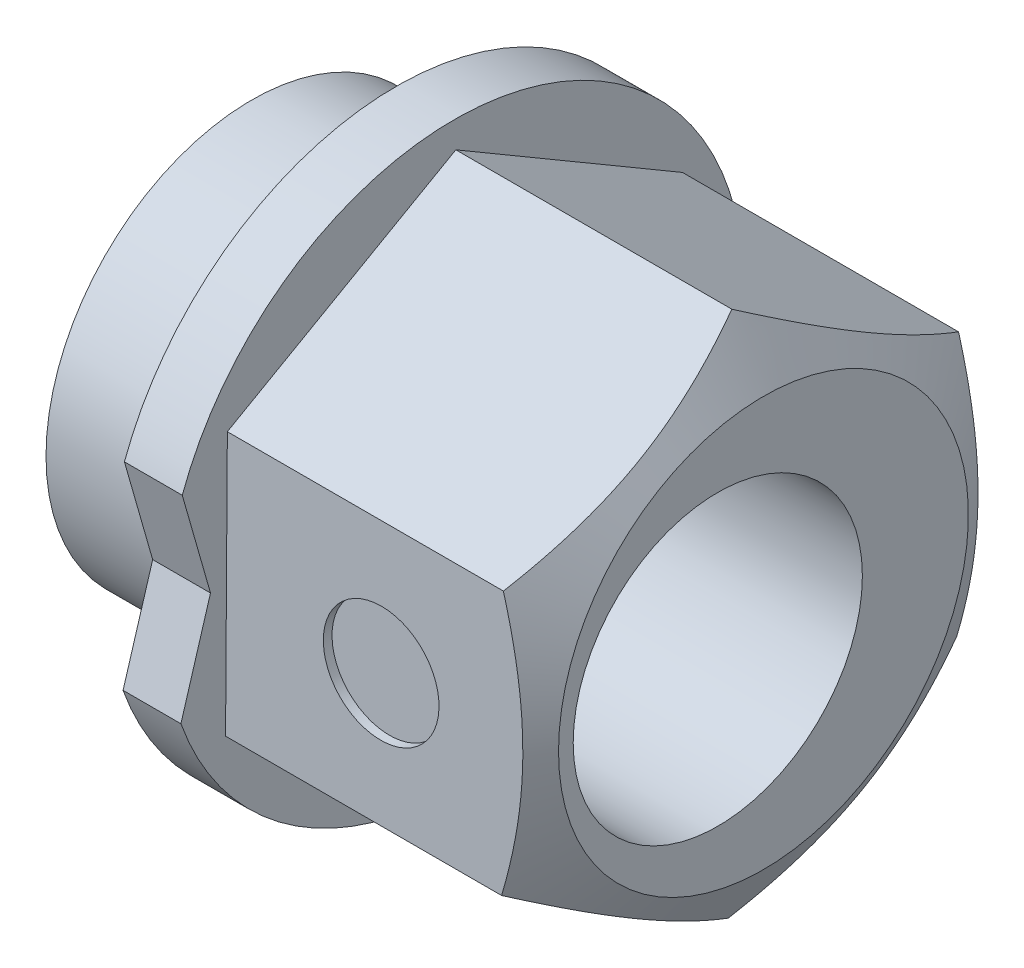
ISO-10303-21;
HEADER;
FILE_DESCRIPTION(('STEP AP214'),'2;1');
FILE_NAME('part.step','',(''),(''),'','','');
FILE_SCHEMA(('AUTOMOTIVE_DESIGN { 1 0 10303 214 1 1 1 1 }'));
ENDSEC;
DATA;
#1=APPLICATION_CONTEXT('core data for automotive mechanical design processes');
#2=APPLICATION_PROTOCOL_DEFINITION('international standard','automotive_design',2000,#1);
#3=PRODUCT_CONTEXT('',#1,'mechanical');
#4=PRODUCT('Part','Part','',(#3));
#5=PRODUCT_RELATED_PRODUCT_CATEGORY('part','',(#4));
#6=PRODUCT_DEFINITION_FORMATION('','',#4);
#7=PRODUCT_DEFINITION_CONTEXT('part definition',#1,'design');
#8=PRODUCT_DEFINITION('design','',#6,#7);
#9=PRODUCT_DEFINITION_SHAPE('','',#8);
#10=(LENGTH_UNIT() NAMED_UNIT(*) SI_UNIT(.MILLI.,.METRE.));
#11=(NAMED_UNIT(*) PLANE_ANGLE_UNIT() SI_UNIT($,.RADIAN.));
#12=(NAMED_UNIT(*) SI_UNIT($,.STERADIAN.) SOLID_ANGLE_UNIT());
#13=UNCERTAINTY_MEASURE_WITH_UNIT(LENGTH_MEASURE(1.E-05),#10,'distance_accuracy_value','');
#14=(GEOMETRIC_REPRESENTATION_CONTEXT(3) GLOBAL_UNCERTAINTY_ASSIGNED_CONTEXT((#13)) GLOBAL_UNIT_ASSIGNED_CONTEXT((#10,
#11,#12)) REPRESENTATION_CONTEXT('',''));
#15=CARTESIAN_POINT('',(0.,0.,0.));
#16=DIRECTION('',(0.,0.,1.));
#17=DIRECTION('',(1.,0.,0.));
#18=AXIS2_PLACEMENT_3D('',#15,#16,#17);
#19=CARTESIAN_POINT('',(5.35,-4.54364126029758,0.0309423828233433));
#20=DIRECTION('',(0.,0.869410264297968,0.494090874569989));
#21=DIRECTION('',(0.,-0.494090874569989,0.869410264297968));
#22=AXIS2_PLACEMENT_3D('',#19,#20,#21);
#23=PLANE('',#22);
#24=DIRECTION('',(0.,0.494090874569989,-0.869410264297968));
#25=VECTOR('',#24,1.);
#26=CARTESIAN_POINT('',(4.77264973081037,-4.54364126029758,0.0309423828233433));
#27=LINE('',#26,#25);
#28=CARTESIAN_POINT('',(4.77264973081037,-4.54364126029758,0.0309423828233433));
#29=VERTEX_POINT('',#28);
#30=CARTESIAN_POINT('',(4.77264973081037,-4.54353714360121,0.0307591774067416));
#31=VERTEX_POINT('',#30);
#32=EDGE_CURVE('E238',#29,#31,#27,.T.);
#33=ORIENTED_EDGE('',*,*,#32,.F.);
#34=DIRECTION('',(-1.,0.,0.));
#35=VECTOR('',#34,1.);
#36=CARTESIAN_POINT('',(5.35,-4.54364126029758,0.0309423828233433));
#37=LINE('',#36,#35);
#38=CARTESIAN_POINT('',(0.,-4.54364126029758,0.0309423828233433));
#39=VERTEX_POINT('',#38);
#40=EDGE_CURVE('E55',#29,#39,#37,.T.);
#41=ORIENTED_EDGE('',*,*,#40,.T.);
#42=DIRECTION('',(0.,0.494090874569989,-0.869410264297968));
#43=VECTOR('',#42,1.);
#44=CARTESIAN_POINT('',(0.,-4.54364126029758,0.0309423828233433));
#45=LINE('',#44,#43);
#46=CARTESIAN_POINT('',(0.,-2.29861751972745,-3.91943756568916));
#47=VERTEX_POINT('',#46);
#48=EDGE_CURVE('E291',#39,#47,#45,.T.);
#49=ORIENTED_EDGE('',*,*,#48,.T.);
#50=DIRECTION('',(-1.,0.,0.));
#51=VECTOR('',#50,1.);
#52=CARTESIAN_POINT('',(5.35,-2.29861751972745,-3.91943756568916));
#53=LINE('',#52,#51);
#54=CARTESIAN_POINT('',(4.77264973081037,-2.29861751972745,-3.91943756568916));
#55=VERTEX_POINT('',#54);
#56=EDGE_CURVE('E260',#55,#47,#53,.T.);
#57=ORIENTED_EDGE('',*,*,#56,.F.);
#58=CARTESIAN_POINT('',(4.77264973081037,-2.29872163642382,-3.91925436027257));
#59=VERTEX_POINT('',#58);
#60=EDGE_CURVE('E240',#59,#55,#27,.T.);
#61=ORIENTED_EDGE('',*,*,#60,.F.);
#62=CARTESIAN_POINT('',(4.77252249257501,-4.5437549214527,0.0311423828233432));
#63=CARTESIAN_POINT('',(4.83018446189932,-4.44509780626388,-0.14245626674864));
#64=CARTESIAN_POINT('',(4.88262583823013,-4.34558908849139,-0.317553409948926));
#65=CARTESIAN_POINT('',(4.97416259753298,-4.14484856970296,-0.67077966138911));
#66=CARTESIAN_POINT('',(5.01322559849631,-4.04361320191933,-0.848915045770918));
#67=CARTESIAN_POINT('',(5.07403259166471,-3.84239708311443,-1.20297817066354));
#68=CARTESIAN_POINT('',(5.09618129094458,-3.74244729091028,-1.3788514355409));
#69=CARTESIAN_POINT('',(5.1226217929783,-3.54207742961478,-1.73142547208403));
#70=CARTESIAN_POINT('',(5.12693549121705,-3.4416580887709,-1.90812496231382));
#71=CARTESIAN_POINT('',(5.11795954206539,-3.2540203419231,-2.23829536511916));
#72=CARTESIAN_POINT('',(5.10687379404681,-3.16677384146384,-2.39181571315104));
#73=CARTESIAN_POINT('',(5.07173908945207,-2.99284924852408,-2.69785622937647));
#74=CARTESIAN_POINT('',(5.04767813181347,-2.90617175757552,-2.85037533910474));
#75=CARTESIAN_POINT('',(4.9875278388602,-2.73188859059485,-3.15704680799033));
#76=CARTESIAN_POINT('',(4.95118353864082,-2.64430497189952,-3.31116035470247));
#77=CARTESIAN_POINT('',(4.86869636125273,-2.47044399379805,-3.61708893323339));
#78=CARTESIAN_POINT('',(4.82257286465198,-2.3841644071245,-3.76890788418783));
#79=CARTESIAN_POINT('',(4.77252249257501,-2.29850385857233,-3.91963756568916));
#80=B_SPLINE_CURVE_WITH_KNOTS('',3,(#62,#63,#64,#65,#66,#67,#68,#69,#70,#71,#72,#73,#74,#75,#76,
#77,#78,#79),.UNSPECIFIED.,.F.,.F.,(4,2,2,2,2,2,2,2,4),(0.,0.623744753764469,1.24898876839455,
1.85875839446027,2.46777920233101,2.99805711762561,3.52882634219932,4.07136862541339,
4.61284557540261),.UNSPECIFIED.);
#81=EDGE_CURVE('E211',#31,#59,#80,.T.);
#82=ORIENTED_EDGE('',*,*,#81,.F.);
#83=EDGE_LOOP('',(#33,#41,#49,#57,#61,#82));
#84=FACE_BOUND('',#83,.T.);
#85=ADVANCED_FACE('F32',(#84),#23,.F.);
#86=CARTESIAN_POINT('',(5.35,-2.29861751972745,-3.91943756568916));
#87=DIRECTION('',(0.,0.00680988299330266,0.999976812477978));
#88=DIRECTION('',(0.,-0.999976812477978,0.00680988299330266));
#89=AXIS2_PLACEMENT_3D('',#86,#87,#88);
#90=PLANE('',#89);
#91=DIRECTION('',(0.,0.999976812477978,-0.00680988299330266));
#92=VECTOR('',#91,1.);
#93=CARTESIAN_POINT('',(4.77264973081037,-2.29861751972745,-3.91943756568916));
#94=LINE('',#93,#92);
#95=CARTESIAN_POINT('',(4.77264973081037,-2.29840680083438,-3.91943900069344));
#96=VERTEX_POINT('',#95);
#97=EDGE_CURVE('E283',#55,#96,#94,.T.);
#98=ORIENTED_EDGE('',*,*,#97,.F.);
#99=ORIENTED_EDGE('',*,*,#56,.T.);
#100=DIRECTION('',(0.,0.999976812477978,-0.00680988299330266));
#101=VECTOR('',#100,1.);
#102=CARTESIAN_POINT('',(0.,-2.29861751972745,-3.91943756568916));
#103=LINE('',#102,#101);
#104=CARTESIAN_POINT('',(0.,2.24502374057014,-3.95037994851252));
#105=VERTEX_POINT('',#104);
#106=EDGE_CURVE('E293',#47,#105,#103,.T.);
#107=ORIENTED_EDGE('',*,*,#106,.T.);
#108=DIRECTION('',(-1.,0.,0.));
#109=VECTOR('',#108,1.);
#110=CARTESIAN_POINT('',(5.35,2.24502374057014,-3.95037994851252));
#111=LINE('',#110,#109);
#112=CARTESIAN_POINT('',(4.77264973081037,2.24502374057014,-3.95037994851252));
#113=VERTEX_POINT('',#112);
#114=EDGE_CURVE('E259',#113,#105,#111,.T.);
#115=ORIENTED_EDGE('',*,*,#114,.F.);
#116=CARTESIAN_POINT('',(4.77264973081037,2.24481302167709,-3.95037851350824));
#117=VERTEX_POINT('',#116);
#118=EDGE_CURVE('E289',#117,#113,#94,.T.);
#119=ORIENTED_EDGE('',*,*,#118,.F.);
#120=CARTESIAN_POINT('',(4.77253116393923,-2.29881751972745,-3.91943620368098));
#121=CARTESIAN_POINT('',(4.83019242109376,-2.09914862844113,-3.92079595699736));
#122=CARTESIAN_POINT('',(4.8826330409757,-1.89775620556924,-3.92216744763432));
#123=CARTESIAN_POINT('',(4.97416823027486,-1.49148410960518,-3.92493417722488));
#124=CARTESIAN_POINT('',(5.01323041867056,-1.28659721815591,-3.92632946533579));
#125=CARTESIAN_POINT('',(5.07403580545695,-0.879362597142383,-3.92910274976131));
#126=CARTESIAN_POINT('',(5.0961837060212,-0.677077522036006,-3.9304803193965));
#127=CARTESIAN_POINT('',(5.12262266428957,-0.271555653578224,-3.93324193990706));
#128=CARTESIAN_POINT('',(5.1269356168253,-0.0683203339816981,-3.93462598074609));
#129=CARTESIAN_POINT('',(5.11795848909764,0.311429419334815,-3.93721209209843));
#130=CARTESIAN_POINT('',(5.10687259675822,0.488000728290139,-3.93841454993441));
#131=CARTESIAN_POINT('',(5.07173828301706,0.839992996868361,-3.94081163168036));
#132=CARTESIAN_POINT('',(5.04767786210512,1.0154127392098,-3.94200624730059));
#133=CARTESIAN_POINT('',(4.98752924463345,1.36813062537293,-3.94440827053197));
#134=CARTESIAN_POINT('',(4.95118610472693,1.54538413189465,-3.94561537416128));
#135=CARTESIAN_POINT('',(4.86870168885514,1.89724759738147,-3.94801157875291));
#136=CARTESIAN_POINT('',(4.8225797912675,2.07186206350711,-3.94920071040918));
#137=CARTESIAN_POINT('',(4.77253116393924,2.24522374057014,-3.9503813105207));
#138=B_SPLINE_CURVE_WITH_KNOTS('',3,(#120,#121,#122,#123,#124,#125,#126,#127,#128,#129,#130,
#131,#132,#133,#134,#135,#136,#137),.UNSPECIFIED.,.F.,.F.,(4,2,2,2,2,2,2,2,4),(0.,
0.62374269709592,1.24898459873569,1.85875236464984,2.46777133481405,2.99803595794767,
3.52879184024593,4.07132007516257,4.6127830764867),.UNSPECIFIED.);
#139=EDGE_CURVE('E207',#96,#117,#138,.T.);
#140=ORIENTED_EDGE('',*,*,#139,.F.);
#141=EDGE_LOOP('',(#98,#99,#107,#115,#119,#140));
#142=FACE_BOUND('',#141,.T.);
#143=ADVANCED_FACE('F216',(#142),#90,.F.);
#144=CARTESIAN_POINT('',(5.35,2.24502374057014,-3.95037994851252));
#145=DIRECTION('',(0.,-0.862600381304665,0.505885937907989));
#146=DIRECTION('',(0.,-0.505885937907989,-0.862600381304665));
#147=AXIS2_PLACEMENT_3D('',#144,#145,#146);
#148=PLANE('',#147);
#149=DIRECTION('',(0.,0.505885937907989,0.862600381304665));
#150=VECTOR('',#149,1.);
#151=CARTESIAN_POINT('',(4.77264973081037,2.24502374057014,-3.95037994851252));
#152=LINE('',#151,#150);
#153=CARTESIAN_POINT('',(4.77264973081037,2.24513034276683,-3.95019817810021));
#154=VERTEX_POINT('',#153);
#155=EDGE_CURVE('E320',#113,#154,#152,.T.);
#156=ORIENTED_EDGE('',*,*,#155,.F.);
#157=ORIENTED_EDGE('',*,*,#114,.T.);
#158=DIRECTION('',(0.,0.505885937907989,0.862600381304665));
#159=VECTOR('',#158,1.);
#160=CARTESIAN_POINT('',(0.,2.24502374057014,-3.95037994851252));
#161=LINE('',#160,#159);
#162=CARTESIAN_POINT('',(0.,4.54364126029758,-0.0309423828233572));
#163=VERTEX_POINT('',#162);
#164=EDGE_CURVE('E296',#105,#163,#161,.T.);
#165=ORIENTED_EDGE('',*,*,#164,.T.);
#166=DIRECTION('',(-1.,0.,0.));
#167=VECTOR('',#166,1.);
#168=CARTESIAN_POINT('',(5.35,4.54364126029758,-0.0309423828233572));
#169=LINE('',#168,#167);
#170=CARTESIAN_POINT('',(4.77264973081037,4.54364126029758,-0.0309423828233572));
#171=VERTEX_POINT('',#170);
#172=EDGE_CURVE('E257',#171,#163,#169,.T.);
#173=ORIENTED_EDGE('',*,*,#172,.F.);
#174=CARTESIAN_POINT('',(4.77264973081037,4.54353465810088,-0.0311241532356663));
#175=VERTEX_POINT('',#174);
#176=EDGE_CURVE('E317',#175,#171,#152,.T.);
#177=ORIENTED_EDGE('',*,*,#176,.F.);
#178=CARTESIAN_POINT('',(4.77252196827759,2.24490644733706,-3.95057994851252));
#179=CARTESIAN_POINT('',(4.83018398066162,2.3459187458398,-3.77834102927067));
#180=CARTESIAN_POINT('',(4.88262540272938,2.4478029766998,-3.60461535357349));
#181=CARTESIAN_POINT('',(4.97416225695894,2.65333565707971,-3.25415578318208));
#182=CARTESIAN_POINT('',(5.01322530705233,2.75698775852406,-3.07741566148852));
#183=CARTESIAN_POINT('',(5.07403239734704,2.96300739344096,-2.72612577118149));
#184=CARTESIAN_POINT('',(5.09618114491948,3.06534322897132,-2.55163005162331));
#185=CARTESIAN_POINT('',(5.12262174029362,3.27049640538847,-2.20181758414277));
#186=CARTESIAN_POINT('',(5.12693548361973,3.37331300063907,-2.02650210762572));
#187=CARTESIAN_POINT('',(5.11795960572909,3.56543023890256,-1.6989175859713));
#188=CARTESIAN_POINT('',(5.10687386643724,3.65475964657023,-1.54659949340975));
#189=CARTESIAN_POINT('',(5.07173913821122,3.83283648365142,-1.2429556558226));
#190=CARTESIAN_POINT('',(5.04767814812076,3.92158329716872,-1.091630960979));
#191=CARTESIAN_POINT('',(4.987527753863,4.10002727102906,-0.787361108114567));
#192=CARTESIAN_POINT('',(4.95118338348752,4.18970184735669,-0.6344544587354));
#193=CARTESIAN_POINT('',(4.86869603912955,4.36771355264578,-0.330921679203984));
#194=CARTESIAN_POINT('',(4.82257244584746,4.45605296206122,-0.180291660585353));
#195=CARTESIAN_POINT('',(4.77252196827759,4.54375855353066,-0.0307423828233579));
#196=B_SPLINE_CURVE_WITH_KNOTS('',3,(#178,#179,#180,#181,#182,#183,#184,#185,#186,#187,#188,
#189,#190,#191,#192,#193,#194,#195),.UNSPECIFIED.,.F.,.F.,(4,2,2,2,2,2,2,2,4),(0.,
0.623744878116952,1.2489890205049,1.85875875904113,2.46777967802528,2.99805839700006,
3.5288284282841,4.07137156089731,4.61284935426144),.UNSPECIFIED.);
#197=EDGE_CURVE('E168',#154,#175,#196,.T.);
#198=ORIENTED_EDGE('',*,*,#197,.F.);
#199=EDGE_LOOP('',(#156,#157,#165,#173,#177,#198));
#200=FACE_BOUND('',#199,.T.);
#201=ADVANCED_FACE('F219',(#200),#148,.F.);
#202=CARTESIAN_POINT('',(5.35,4.54364126029758,-0.0309423828233572));
#203=DIRECTION('',(0.,-0.869410264297969,-0.494090874569989));
#204=DIRECTION('',(0.,0.494090874569989,-0.869410264297969));
#205=AXIS2_PLACEMENT_3D('',#202,#203,#204);
#206=PLANE('',#205);
#207=DIRECTION('',(0.,-0.494090874569989,0.869410264297969));
#208=VECTOR('',#207,1.);
#209=CARTESIAN_POINT('',(4.77264973081037,4.54364126029758,-0.0309423828233572));
#210=LINE('',#209,#208);
#211=CARTESIAN_POINT('',(4.77264973081037,4.54353714360121,-0.030759177406767));
#212=VERTEX_POINT('',#211);
#213=EDGE_CURVE('E313',#171,#212,#210,.T.);
#214=ORIENTED_EDGE('',*,*,#213,.F.);
#215=ORIENTED_EDGE('',*,*,#172,.T.);
#216=DIRECTION('',(0.,-0.494090874569989,0.869410264297968));
#217=VECTOR('',#216,1.);
#218=CARTESIAN_POINT('',(0.,4.54364126029758,-0.0309423828233572));
#219=LINE('',#218,#217);
#220=CARTESIAN_POINT('',(0.,2.29861751972744,3.91943756568916));
#221=VERTEX_POINT('',#220);
#222=EDGE_CURVE('E305',#163,#221,#219,.T.);
#223=ORIENTED_EDGE('',*,*,#222,.T.);
#224=DIRECTION('',(-1.,0.,0.));
#225=VECTOR('',#224,1.);
#226=CARTESIAN_POINT('',(5.35,2.29861751972744,3.91943756568916));
#227=LINE('',#226,#225);
#228=CARTESIAN_POINT('',(4.77264973081037,2.29861751972744,3.91943756568916));
#229=VERTEX_POINT('',#228);
#230=EDGE_CURVE('E250',#229,#221,#227,.T.);
#231=ORIENTED_EDGE('',*,*,#230,.F.);
#232=CARTESIAN_POINT('',(4.77264973081037,2.2987216364238,3.91925436027258));
#233=VERTEX_POINT('',#232);
#234=EDGE_CURVE('E145',#233,#229,#210,.T.);
#235=ORIENTED_EDGE('',*,*,#234,.F.);
#236=CARTESIAN_POINT('',(4.77252249257501,4.5437549214527,-0.031142382823357));
#237=CARTESIAN_POINT('',(4.83018446189932,4.44509780626387,0.142456266748626));
#238=CARTESIAN_POINT('',(4.88262583823013,4.34558908849138,0.317553409948912));
#239=CARTESIAN_POINT('',(4.97416259753299,4.14484856970295,0.670779661389096));
#240=CARTESIAN_POINT('',(5.01322559849631,4.04361320191932,0.848915045770903));
#241=CARTESIAN_POINT('',(5.07403259166472,3.84239708311442,1.20297817066352));
#242=CARTESIAN_POINT('',(5.09618129094458,3.74244729091027,1.37885143554089));
#243=CARTESIAN_POINT('',(5.1226217929783,3.54207742961477,1.73142547208402));
#244=CARTESIAN_POINT('',(5.12693549121706,3.4416580887709,1.9081249623138));
#245=CARTESIAN_POINT('',(5.1179595420654,3.2540203419231,2.23829536511915));
#246=CARTESIAN_POINT('',(5.10687379404682,3.16677384146383,2.39181571315103));
#247=CARTESIAN_POINT('',(5.07173908945208,2.99284924852407,2.69785622937646));
#248=CARTESIAN_POINT('',(5.04767813181348,2.90617175757551,2.85037533910472));
#249=CARTESIAN_POINT('',(4.9875278388602,2.73188859059484,3.15704680799032));
#250=CARTESIAN_POINT('',(4.95118353864083,2.64430497189951,3.31116035470246));
#251=CARTESIAN_POINT('',(4.86869636125274,2.47044399379804,3.61708893323339));
#252=CARTESIAN_POINT('',(4.82257286465199,2.38416440712448,3.76890788418783));
#253=CARTESIAN_POINT('',(4.77252249257501,2.29850385857232,3.91963756568916));
#254=B_SPLINE_CURVE_WITH_KNOTS('',3,(#236,#237,#238,#239,#240,#241,#242,#243,#244,#245,#246,
#247,#248,#249,#250,#251,#252,#253),.UNSPECIFIED.,.F.,.F.,(4,2,2,2,2,2,2,2,4),(0.,
0.623744753764469,1.24898876839455,1.85875839446027,2.46777920233101,2.99805711762561,
3.52882634219932,4.0713686254134,4.61284557540263),.UNSPECIFIED.);
#255=EDGE_CURVE('E158',#212,#233,#254,.T.);
#256=ORIENTED_EDGE('',*,*,#255,.F.);
#257=EDGE_LOOP('',(#214,#215,#223,#231,#235,#256));
#258=FACE_BOUND('',#257,.T.);
#259=ADVANCED_FACE('F223',(#258),#206,.F.);
#260=CARTESIAN_POINT('',(5.35,2.29861751972744,3.91943756568916));
#261=DIRECTION('',(0.,-0.00680988299330344,-0.999976812477978));
#262=DIRECTION('',(0.,0.999976812477978,-0.00680988299330344));
#263=AXIS2_PLACEMENT_3D('',#260,#261,#262);
#264=PLANE('',#263);
#265=CARTESIAN_POINT('',(2.675,0.0267968895786493,3.93490875710084));
#266=DIRECTION('',(0.,-0.00680988299330344,-0.999976812477978));
#267=DIRECTION('',(0.,0.999976812477978,-0.00680988299330344));
#268=AXIS2_PLACEMENT_3D('',#265,#266,#267);
#269=CIRCLE('',#268,0.999999999999998);
#270=CARTESIAN_POINT('',(2.675,1.02677370205663,3.92809887410754));
#271=VERTEX_POINT('',#270);
#272=EDGE_CURVE('E327',#271,#271,#269,.T.);
#273=ORIENTED_EDGE('',*,*,#272,.T.);
#274=EDGE_LOOP('',(#273));
#275=FACE_BOUND('',#274,.T.);
#276=DIRECTION('',(0.,-0.999976812477978,0.00680988299330344));
#277=VECTOR('',#276,1.);
#278=CARTESIAN_POINT('',(4.77264973081037,2.29861751972744,3.91943756568916));
#279=LINE('',#278,#277);
#280=CARTESIAN_POINT('',(4.77264973081037,2.29840680083438,3.91943900069344));
#281=VERTEX_POINT('',#280);
#282=EDGE_CURVE('E140',#229,#281,#279,.T.);
#283=ORIENTED_EDGE('',*,*,#282,.F.);
#284=ORIENTED_EDGE('',*,*,#230,.T.);
#285=DIRECTION('',(0.,-0.999976812477978,0.00680988299330344));
#286=VECTOR('',#285,1.);
#287=CARTESIAN_POINT('',(0.,2.29861751972744,3.91943756568916));
#288=LINE('',#287,#286);
#289=CARTESIAN_POINT('',(0.,-2.24502374057014,3.95037994851252));
#290=VERTEX_POINT('',#289);
#291=EDGE_CURVE('E252',#221,#290,#288,.T.);
#292=ORIENTED_EDGE('',*,*,#291,.T.);
#293=DIRECTION('',(-1.,0.,0.));
#294=VECTOR('',#293,1.);
#295=CARTESIAN_POINT('',(5.35,-2.24502374057014,3.95037994851252));
#296=LINE('',#295,#294);
#297=CARTESIAN_POINT('',(4.77264973081037,-2.24502374057014,3.95037994851252));
#298=VERTEX_POINT('',#297);
#299=EDGE_CURVE('E248',#298,#290,#296,.T.);
#300=ORIENTED_EDGE('',*,*,#299,.F.);
#301=CARTESIAN_POINT('',(4.77264973081037,-2.24481302167709,3.95037851350824));
#302=VERTEX_POINT('',#301);
#303=EDGE_CURVE('E149',#302,#298,#279,.T.);
#304=ORIENTED_EDGE('',*,*,#303,.F.);
#305=CARTESIAN_POINT('',(4.77253116393924,2.29881751972744,3.91943620368098));
#306=CARTESIAN_POINT('',(4.83019242109376,2.09914862844111,3.92079595699735));
#307=CARTESIAN_POINT('',(4.88263304097571,1.89775620556923,3.92216744763432));
#308=CARTESIAN_POINT('',(4.97416823027487,1.49148410960517,3.92493417722488));
#309=CARTESIAN_POINT('',(5.01323041867056,1.2865972181559,3.92632946533578));
#310=CARTESIAN_POINT('',(5.07403580545695,0.879362597142374,3.9291027497613));
#311=CARTESIAN_POINT('',(5.0961837060212,0.677077522035997,3.9304803193965));
#312=CARTESIAN_POINT('',(5.12262266428957,0.271555653578215,3.93324193990705));
#313=CARTESIAN_POINT('',(5.1269356168253,0.0683203339816897,3.93462598074609));
#314=CARTESIAN_POINT('',(5.11795848909764,-0.311429419334822,3.93721209209843));
#315=CARTESIAN_POINT('',(5.10687259675822,-0.488000728290145,3.9384145499344));
#316=CARTESIAN_POINT('',(5.07173828301706,-0.839992996868366,3.94081163168035));
#317=CARTESIAN_POINT('',(5.04767786210512,-1.0154127392098,3.94200624730059));
#318=CARTESIAN_POINT('',(4.98752924463345,-1.36813062537293,3.94440827053197));
#319=CARTESIAN_POINT('',(4.95118610472693,-1.54538413189465,3.94561537416128));
#320=CARTESIAN_POINT('',(4.86870168885514,-1.89724759738148,3.94801157875291));
#321=CARTESIAN_POINT('',(4.8225797912675,-2.07186206350711,3.94920071040918));
#322=CARTESIAN_POINT('',(4.77253116393924,-2.24522374057014,3.9503813105207));
#323=B_SPLINE_CURVE_WITH_KNOTS('',3,(#305,#306,#307,#308,#309,#310,#311,#312,#313,#314,#315,
#316,#317,#318,#319,#320,#321,#322),.UNSPECIFIED.,.F.,.F.,(4,2,2,2,2,2,2,2,4),(0.,
0.623742697095919,1.24898459873569,1.85875236464984,2.46777133481404,2.99803595794766,
3.52879184024592,4.07132007516255,4.61278307648668),.UNSPECIFIED.);
#324=EDGE_CURVE('E154',#281,#302,#323,.T.);
#325=ORIENTED_EDGE('',*,*,#324,.F.);
#326=EDGE_LOOP('',(#283,#284,#292,#300,#304,#325));
#327=FACE_BOUND('',#326,.T.);
#328=ADVANCED_FACE('F164',(#275,#327),#264,.F.);
#329=CARTESIAN_POINT('',(5.35,-2.24502374057014,3.95037994851252));
#330=DIRECTION('',(0.,0.862600381304665,-0.50588593790799));
#331=DIRECTION('',(0.,0.50588593790799,0.862600381304665));
#332=AXIS2_PLACEMENT_3D('',#329,#330,#331);
#333=PLANE('',#332);
#334=DIRECTION('',(0.,-0.50588593790799,-0.862600381304665));
#335=VECTOR('',#334,1.);
#336=CARTESIAN_POINT('',(4.77264973081037,-2.24502374057014,3.95037994851252));
#337=LINE('',#336,#335);
#338=CARTESIAN_POINT('',(4.77264973081037,-2.24513034276683,3.95019817810021));
#339=VERTEX_POINT('',#338);
#340=EDGE_CURVE('E11',#298,#339,#337,.T.);
#341=ORIENTED_EDGE('',*,*,#340,.F.);
#342=ORIENTED_EDGE('',*,*,#299,.T.);
#343=DIRECTION('',(0.,-0.50588593790799,-0.862600381304665));
#344=VECTOR('',#343,1.);
#345=CARTESIAN_POINT('',(0.,-2.24502374057014,3.95037994851252));
#346=LINE('',#345,#344);
#347=EDGE_CURVE('E247',#290,#39,#346,.T.);
#348=ORIENTED_EDGE('',*,*,#347,.T.);
#349=ORIENTED_EDGE('',*,*,#40,.F.);
#350=CARTESIAN_POINT('',(4.77264973081037,-4.54353465810089,0.0311241532356659));
#351=VERTEX_POINT('',#350);
#352=EDGE_CURVE('E36',#351,#29,#337,.T.);
#353=ORIENTED_EDGE('',*,*,#352,.F.);
#354=CARTESIAN_POINT('',(4.77252196827759,-2.24490644733706,3.95057994851252));
#355=CARTESIAN_POINT('',(4.83018398066162,-2.34591874583979,3.77834102927067));
#356=CARTESIAN_POINT('',(4.88262540272938,-2.44780297669979,3.60461535357349));
#357=CARTESIAN_POINT('',(4.97416225695894,-2.65333565707971,3.25415578318208));
#358=CARTESIAN_POINT('',(5.01322530705233,-2.75698775852406,3.07741566148852));
#359=CARTESIAN_POINT('',(5.07403239734704,-2.96300739344096,2.72612577118149));
#360=CARTESIAN_POINT('',(5.09618114491948,-3.06534322897131,2.55163005162331));
#361=CARTESIAN_POINT('',(5.12262174029362,-3.27049640538847,2.20181758414277));
#362=CARTESIAN_POINT('',(5.12693548361973,-3.37331300063907,2.02650210762572));
#363=CARTESIAN_POINT('',(5.11795960572909,-3.56543023890256,1.6989175859713));
#364=CARTESIAN_POINT('',(5.10687386643724,-3.65475964657023,1.54659949340975));
#365=CARTESIAN_POINT('',(5.07173913821122,-3.83283648365142,1.2429556558226));
#366=CARTESIAN_POINT('',(5.04767814812075,-3.92158329716872,1.09163096097899));
#367=CARTESIAN_POINT('',(4.987527753863,-4.10002727102906,0.787361108114558));
#368=CARTESIAN_POINT('',(4.95118338348752,-4.18970184735669,0.634454458735391));
#369=CARTESIAN_POINT('',(4.86869603912954,-4.36771355264579,0.330921679203973));
#370=CARTESIAN_POINT('',(4.82257244584746,-4.45605296206123,0.18029166058534));
#371=CARTESIAN_POINT('',(4.77252196827758,-4.54375855353067,0.0307423828233436));
#372=B_SPLINE_CURVE_WITH_KNOTS('',3,(#354,#355,#356,#357,#358,#359,#360,#361,#362,#363,#364,
#365,#366,#367,#368,#369,#370,#371),.UNSPECIFIED.,.F.,.F.,(4,2,2,2,2,2,2,2,4),(0.,
0.623744878116952,1.2489890205049,1.85875875904113,2.46777967802528,2.99805839700007,
3.52882842828411,4.07137156089733,4.61284935426146),.UNSPECIFIED.);
#373=EDGE_CURVE('E166',#339,#351,#372,.T.);
#374=ORIENTED_EDGE('',*,*,#373,.F.);
#375=EDGE_LOOP('',(#341,#342,#348,#349,#353,#374));
#376=FACE_BOUND('',#375,.T.);
#377=ADVANCED_FACE('F231',(#376),#333,.F.);
#378=CARTESIAN_POINT('',(5.35,0.,0.));
#379=DIRECTION('',(1.,0.,0.));
#380=DIRECTION('',(0.,0.,-1.));
#381=AXIS2_PLACEMENT_3D('',#378,#379,#380);
#382=PLANE('',#381);
#383=CARTESIAN_POINT('',(5.35,0.,0.79));
#384=DIRECTION('',(-1.,0.,0.));
#385=DIRECTION('',(0.,0.,1.));
#386=AXIS2_PLACEMENT_3D('',#383,#384,#385);
#387=CIRCLE('',#386,2.5);
#388=CARTESIAN_POINT('',(5.35,0.,3.29));
#389=VERTEX_POINT('',#388);
#390=EDGE_CURVE('E324',#389,#389,#387,.T.);
#391=ORIENTED_EDGE('',*,*,#390,.T.);
#392=EDGE_LOOP('',(#391));
#393=FACE_BOUND('',#392,.T.);
#394=CARTESIAN_POINT('',(5.35,0.,0.));
#395=DIRECTION('',(-1.,0.,0.));
#396=DIRECTION('',(0.,0.,1.));
#397=AXIS2_PLACEMENT_3D('',#394,#395,#396);
#398=CIRCLE('',#397,3.54364126029758);
#399=CARTESIAN_POINT('',(5.35,0.,3.54364126029758));
#400=VERTEX_POINT('',#399);
#401=EDGE_CURVE('E159',#400,#400,#398,.T.);
#402=ORIENTED_EDGE('',*,*,#401,.F.);
#403=EDGE_LOOP('',(#402));
#404=FACE_BOUND('',#403,.T.);
#405=ADVANCED_FACE('F384',(#393,#404),#382,.T.);
#406=CARTESIAN_POINT('',(0.,0.,0.));
#407=DIRECTION('',(-1.,0.,0.));
#408=DIRECTION('',(0.,0.,1.));
#409=AXIS2_PLACEMENT_3D('',#406,#407,#408);
#410=PLANE('',#409);
#411=CARTESIAN_POINT('',(0.,0.,0.));
#412=DIRECTION('',(-1.,0.,0.));
#413=DIRECTION('',(0.,0.,1.));
#414=AXIS2_PLACEMENT_3D('',#411,#412,#413);
#415=CIRCLE('',#414,5.01);
#416=CARTESIAN_POINT('',(0.,1.73708093898426,4.69921799998868));
#417=VERTEX_POINT('',#416);
#418=CARTESIAN_POINT('',(0.,-1.67291906101574,4.72244023946203));
#419=VERTEX_POINT('',#418);
#420=EDGE_CURVE('E339',#417,#419,#415,.T.);
#421=ORIENTED_EDGE('',*,*,#420,.F.);
#422=DIRECTION('',(0.,0.961485049323104,0.274857235539013));
#423=VECTOR('',#422,1.);
#424=CARTESIAN_POINT('',(0.,1.73708093898426,4.69921799998868));
#425=LINE('',#424,#423);
#426=CARTESIAN_POINT('',(0.,0.0286759974876035,4.21084071348636));
#427=VERTEX_POINT('',#426);
#428=EDGE_CURVE('E346',#427,#417,#425,.T.);
#429=ORIENTED_EDGE('',*,*,#428,.F.);
#430=DIRECTION('',(0.,0.957652468108509,-0.287926640527897));
#431=VECTOR('',#430,1.);
#432=CARTESIAN_POINT('',(0.,0.0286759974876035,4.21084071348636));
#433=LINE('',#432,#431);
#434=EDGE_CURVE('E353',#419,#427,#433,.T.);
#435=ORIENTED_EDGE('',*,*,#434,.F.);
#436=EDGE_LOOP('',(#421,#429,#435));
#437=FACE_BOUND('',#436,.T.);
#438=ORIENTED_EDGE('',*,*,#106,.F.);
#439=ORIENTED_EDGE('',*,*,#48,.F.);
#440=ORIENTED_EDGE('',*,*,#347,.F.);
#441=ORIENTED_EDGE('',*,*,#291,.F.);
#442=ORIENTED_EDGE('',*,*,#222,.F.);
#443=ORIENTED_EDGE('',*,*,#164,.F.);
#444=EDGE_LOOP('',(#438,#439,#440,#441,#442,#443));
#445=FACE_BOUND('',#444,.T.);
#446=ADVANCED_FACE('F310',(#437,#445),#410,.F.);
#447=CARTESIAN_POINT('',(-1.,0.,0.));
#448=DIRECTION('',(1.,0.,0.));
#449=DIRECTION('',(0.,0.,-1.));
#450=AXIS2_PLACEMENT_3D('',#447,#448,#449);
#451=CYLINDRICAL_SURFACE('',#450,5.01);
#452=ORIENTED_EDGE('',*,*,#420,.T.);
#453=DIRECTION('',(1.,0.,0.));
#454=VECTOR('',#453,1.);
#455=CARTESIAN_POINT('',(-1.,-1.67291906101574,4.72244023946203));
#456=LINE('',#455,#454);
#457=CARTESIAN_POINT('',(-1.,-1.67291906101574,4.72244023946203));
#458=VERTEX_POINT('',#457);
#459=EDGE_CURVE('E294',#458,#419,#456,.T.);
#460=ORIENTED_EDGE('',*,*,#459,.F.);
#461=CARTESIAN_POINT('',(-1.,0.,0.));
#462=DIRECTION('',(-1.,0.,0.));
#463=DIRECTION('',(0.,0.,1.));
#464=AXIS2_PLACEMENT_3D('',#461,#462,#463);
#465=CIRCLE('',#464,5.01);
#466=CARTESIAN_POINT('',(-1.,1.73708093898426,4.69921799998868));
#467=VERTEX_POINT('',#466);
#468=EDGE_CURVE('E342',#467,#458,#465,.T.);
#469=ORIENTED_EDGE('',*,*,#468,.F.);
#470=DIRECTION('',(1.,0.,0.));
#471=VECTOR('',#470,1.);
#472=CARTESIAN_POINT('',(-1.,1.73708093898426,4.69921799998868));
#473=LINE('',#472,#471);
#474=EDGE_CURVE('E350',#467,#417,#473,.T.);
#475=ORIENTED_EDGE('',*,*,#474,.T.);
#476=EDGE_LOOP('',(#452,#460,#469,#475));
#477=FACE_BOUND('',#476,.T.);
#478=ADVANCED_FACE('F369',(#477),#451,.T.);
#479=CARTESIAN_POINT('',(-1.,0.0286759974876035,4.21084071348636));
#480=DIRECTION('',(0.,-0.287926640527897,-0.957652468108509));
#481=DIRECTION('',(0.,0.957652468108509,-0.287926640527897));
#482=AXIS2_PLACEMENT_3D('',#479,#480,#481);
#483=PLANE('',#482);
#484=ORIENTED_EDGE('',*,*,#434,.T.);
#485=DIRECTION('',(1.,0.,0.));
#486=VECTOR('',#485,1.);
#487=CARTESIAN_POINT('',(-1.,0.0286759974876035,4.21084071348636));
#488=LINE('',#487,#486);
#489=CARTESIAN_POINT('',(-1.,0.0286759974876035,4.21084071348636));
#490=VERTEX_POINT('',#489);
#491=EDGE_CURVE('E299',#490,#427,#488,.T.);
#492=ORIENTED_EDGE('',*,*,#491,.F.);
#493=DIRECTION('',(0.,0.957652468108509,-0.287926640527897));
#494=VECTOR('',#493,1.);
#495=CARTESIAN_POINT('',(-1.,0.0286759974876035,4.21084071348636));
#496=LINE('',#495,#494);
#497=EDGE_CURVE('E345',#458,#490,#496,.T.);
#498=ORIENTED_EDGE('',*,*,#497,.F.);
#499=ORIENTED_EDGE('',*,*,#459,.T.);
#500=EDGE_LOOP('',(#484,#492,#498,#499));
#501=FACE_BOUND('',#500,.T.);
#502=ADVANCED_FACE('F373',(#501),#483,.F.);
#503=CARTESIAN_POINT('',(-1.,1.73708093898426,4.69921799998868));
#504=DIRECTION('',(0.,0.274857235539013,-0.961485049323104));
#505=DIRECTION('',(0.,0.961485049323104,0.274857235539013));
#506=AXIS2_PLACEMENT_3D('',#503,#504,#505);
#507=PLANE('',#506);
#508=ORIENTED_EDGE('',*,*,#428,.T.);
#509=ORIENTED_EDGE('',*,*,#474,.F.);
#510=DIRECTION('',(0.,0.961485049323104,0.274857235539013));
#511=VECTOR('',#510,1.);
#512=CARTESIAN_POINT('',(-1.,1.73708093898426,4.69921799998868));
#513=LINE('',#512,#511);
#514=EDGE_CURVE('E348',#490,#467,#513,.T.);
#515=ORIENTED_EDGE('',*,*,#514,.F.);
#516=ORIENTED_EDGE('',*,*,#491,.T.);
#517=EDGE_LOOP('',(#508,#509,#515,#516));
#518=FACE_BOUND('',#517,.T.);
#519=ADVANCED_FACE('F362',(#518),#507,.F.);
#520=CARTESIAN_POINT('',(-1.,0.,0.));
#521=DIRECTION('',(-1.,0.,0.));
#522=DIRECTION('',(0.,0.,1.));
#523=AXIS2_PLACEMENT_3D('',#520,#521,#522);
#524=PLANE('',#523);
#525=CARTESIAN_POINT('',(-1.,0.,0.));
#526=DIRECTION('',(-1.,0.,0.));
#527=DIRECTION('',(0.,0.,1.));
#528=AXIS2_PLACEMENT_3D('',#525,#526,#527);
#529=CIRCLE('',#528,3.555);
#530=CARTESIAN_POINT('',(-1.,0.,3.555));
#531=VERTEX_POINT('',#530);
#532=EDGE_CURVE('E333',#531,#531,#529,.T.);
#533=ORIENTED_EDGE('',*,*,#532,.F.);
#534=EDGE_LOOP('',(#533));
#535=FACE_BOUND('',#534,.T.);
#536=ORIENTED_EDGE('',*,*,#468,.T.);
#537=ORIENTED_EDGE('',*,*,#497,.T.);
#538=ORIENTED_EDGE('',*,*,#514,.T.);
#539=EDGE_LOOP('',(#536,#537,#538));
#540=FACE_BOUND('',#539,.T.);
#541=ADVANCED_FACE('F372',(#535,#540),#524,.T.);
#542=CARTESIAN_POINT('',(-3.5,0.,0.));
#543=DIRECTION('',(1.,0.,0.));
#544=DIRECTION('',(0.,0.,-1.));
#545=AXIS2_PLACEMENT_3D('',#542,#543,#544);
#546=CYLINDRICAL_SURFACE('',#545,3.555);
#547=CARTESIAN_POINT('',(-3.5,0.,0.));
#548=DIRECTION('',(-1.,0.,0.));
#549=DIRECTION('',(0.,0.,1.));
#550=AXIS2_PLACEMENT_3D('',#547,#548,#549);
#551=CIRCLE('',#550,3.555);
#552=CARTESIAN_POINT('',(-3.5,0.,3.555));
#553=VERTEX_POINT('',#552);
#554=EDGE_CURVE('E336',#553,#553,#551,.T.);
#555=ORIENTED_EDGE('',*,*,#554,.F.);
#556=EDGE_LOOP('',(#555));
#557=FACE_BOUND('',#556,.T.);
#558=ORIENTED_EDGE('',*,*,#532,.T.);
#559=EDGE_LOOP('',(#558));
#560=FACE_BOUND('',#559,.T.);
#561=ADVANCED_FACE('F425',(#557,#560),#546,.T.);
#562=CARTESIAN_POINT('',(-3.5,0.,0.));
#563=DIRECTION('',(-1.,0.,0.));
#564=DIRECTION('',(0.,0.,1.));
#565=AXIS2_PLACEMENT_3D('',#562,#563,#564);
#566=PLANE('',#565);
#567=CARTESIAN_POINT('',(-3.5,0.,0.79));
#568=DIRECTION('',(-1.,0.,0.));
#569=DIRECTION('',(0.,0.,1.));
#570=AXIS2_PLACEMENT_3D('',#567,#568,#569);
#571=CIRCLE('',#570,2.5);
#572=CARTESIAN_POINT('',(-3.5,0.,3.29));
#573=VERTEX_POINT('',#572);
#574=EDGE_CURVE('E286',#573,#573,#571,.T.);
#575=ORIENTED_EDGE('',*,*,#574,.F.);
#576=EDGE_LOOP('',(#575));
#577=FACE_BOUND('',#576,.T.);
#578=ORIENTED_EDGE('',*,*,#554,.T.);
#579=EDGE_LOOP('',(#578));
#580=FACE_BOUND('',#579,.T.);
#581=ADVANCED_FACE('F435',(#577,#580),#566,.T.);
#582=CARTESIAN_POINT('',(2.675,0.0257754071296538,3.78491223522914));
#583=DIRECTION('',(0.,0.00680988299330344,0.999976812477978));
#584=DIRECTION('',(0.,-0.999976812477978,0.00680988299330344));
#585=AXIS2_PLACEMENT_3D('',#582,#583,#584);
#586=CYLINDRICAL_SURFACE('',#585,0.999999999999998);
#587=CARTESIAN_POINT('',(2.675,0.0257754071296538,3.78491223522914));
#588=DIRECTION('',(0.,-0.00680988299330344,-0.999976812477978));
#589=DIRECTION('',(0.,0.999976812477978,-0.00680988299330344));
#590=AXIS2_PLACEMENT_3D('',#587,#588,#589);
#591=CIRCLE('',#590,0.999999999999998);
#592=CARTESIAN_POINT('',(2.675,1.02575221960763,3.77810235223584));
#593=VERTEX_POINT('',#592);
#594=EDGE_CURVE('E330',#593,#593,#591,.T.);
#595=ORIENTED_EDGE('',*,*,#594,.T.);
#596=EDGE_LOOP('',(#595));
#597=FACE_BOUND('',#596,.T.);
#598=ORIENTED_EDGE('',*,*,#272,.F.);
#599=EDGE_LOOP('',(#598));
#600=FACE_BOUND('',#599,.T.);
#601=ADVANCED_FACE('F443',(#597,#600),#586,.F.);
#602=CARTESIAN_POINT('',(2.675,0.0257754071296538,3.78491223522914));
#603=DIRECTION('',(0.,-0.00680988299330344,-0.999976812477978));
#604=DIRECTION('',(0.,0.999976812477978,-0.00680988299330344));
#605=AXIS2_PLACEMENT_3D('',#602,#603,#604);
#606=PLANE('',#605);
#607=ORIENTED_EDGE('',*,*,#594,.F.);
#608=EDGE_LOOP('',(#607));
#609=FACE_BOUND('',#608,.T.);
#610=ADVANCED_FACE('F280',(#609),#606,.F.);
#611=CARTESIAN_POINT('',(5.35,0.,0.79));
#612=DIRECTION('',(-1.,0.,0.));
#613=DIRECTION('',(0.,0.,1.));
#614=AXIS2_PLACEMENT_3D('',#611,#612,#613);
#615=CYLINDRICAL_SURFACE('',#614,2.5);
#616=ORIENTED_EDGE('',*,*,#390,.F.);
#617=EDGE_LOOP('',(#616));
#618=FACE_BOUND('',#617,.T.);
#619=ORIENTED_EDGE('',*,*,#574,.T.);
#620=EDGE_LOOP('',(#619));
#621=FACE_BOUND('',#620,.T.);
#622=ADVANCED_FACE('F194',(#618,#621),#615,.F.);
#623=CARTESIAN_POINT('',(4.77264973081037,8.54364126029758,0.));
#624=DIRECTION('',(1.,0.,0.));
#625=DIRECTION('',(0.,0.,-1.));
#626=AXIS2_PLACEMENT_3D('',#623,#624,#625);
#627=PLANE('',#626);
#628=ORIENTED_EDGE('',*,*,#60,.T.);
#629=ORIENTED_EDGE('',*,*,#97,.T.);
#630=CARTESIAN_POINT('',(4.77264973081037,0.,0.));
#631=DIRECTION('',(-1.,0.,0.));
#632=DIRECTION('',(0.,0.,1.));
#633=AXIS2_PLACEMENT_3D('',#630,#631,#632);
#634=CIRCLE('',#633,4.54364126029758);
#635=EDGE_CURVE('E285',#96,#59,#634,.T.);
#636=ORIENTED_EDGE('',*,*,#635,.T.);
#637=EDGE_LOOP('',(#628,#629,#636));
#638=FACE_BOUND('',#637,.T.);
#639=ADVANCED_FACE('F193',(#638),#627,.T.);
#640=ORIENTED_EDGE('',*,*,#118,.T.);
#641=ORIENTED_EDGE('',*,*,#155,.T.);
#642=EDGE_CURVE('E546',#154,#117,#634,.T.);
#643=ORIENTED_EDGE('',*,*,#642,.T.);
#644=EDGE_LOOP('',(#640,#641,#643));
#645=FACE_BOUND('',#644,.T.);
#646=ADVANCED_FACE('F272',(#645),#627,.T.);
#647=ORIENTED_EDGE('',*,*,#176,.T.);
#648=ORIENTED_EDGE('',*,*,#213,.T.);
#649=EDGE_CURVE('E160',#212,#175,#634,.T.);
#650=ORIENTED_EDGE('',*,*,#649,.T.);
#651=EDGE_LOOP('',(#647,#648,#650));
#652=FACE_BOUND('',#651,.T.);
#653=ADVANCED_FACE('F278',(#652),#627,.T.);
#654=ORIENTED_EDGE('',*,*,#234,.T.);
#655=ORIENTED_EDGE('',*,*,#282,.T.);
#656=EDGE_CURVE('E143',#281,#233,#634,.T.);
#657=ORIENTED_EDGE('',*,*,#656,.T.);
#658=EDGE_LOOP('',(#654,#655,#657));
#659=FACE_BOUND('',#658,.T.);
#660=ADVANCED_FACE('F142',(#659),#627,.T.);
#661=ORIENTED_EDGE('',*,*,#303,.T.);
#662=ORIENTED_EDGE('',*,*,#340,.T.);
#663=EDGE_CURVE('E162',#339,#302,#634,.T.);
#664=ORIENTED_EDGE('',*,*,#663,.T.);
#665=EDGE_LOOP('',(#661,#662,#664));
#666=FACE_BOUND('',#665,.T.);
#667=ADVANCED_FACE('F266',(#666),#627,.T.);
#668=ORIENTED_EDGE('',*,*,#32,.T.);
#669=EDGE_CURVE('E47',#31,#351,#634,.T.);
#670=ORIENTED_EDGE('',*,*,#669,.T.);
#671=ORIENTED_EDGE('',*,*,#352,.T.);
#672=EDGE_LOOP('',(#668,#670,#671));
#673=FACE_BOUND('',#672,.T.);
#674=ADVANCED_FACE('F191',(#673),#627,.T.);
#675=CARTESIAN_POINT('',(4.77264973081037,0.,0.));
#676=DIRECTION('',(-1.,0.,0.));
#677=DIRECTION('',(0.,0.,1.));
#678=AXIS2_PLACEMENT_3D('',#675,#676,#677);
#679=CONICAL_SURFACE('',#678,4.54364126029758,1.0471975511966);
#680=ORIENTED_EDGE('',*,*,#401,.T.);
#681=EDGE_LOOP('',(#680));
#682=FACE_BOUND('',#681,.T.);
#683=ORIENTED_EDGE('',*,*,#81,.T.);
#684=ORIENTED_EDGE('',*,*,#635,.F.);
#685=ORIENTED_EDGE('',*,*,#139,.T.);
#686=ORIENTED_EDGE('',*,*,#642,.F.);
#687=ORIENTED_EDGE('',*,*,#197,.T.);
#688=ORIENTED_EDGE('',*,*,#649,.F.);
#689=ORIENTED_EDGE('',*,*,#255,.T.);
#690=ORIENTED_EDGE('',*,*,#656,.F.);
#691=ORIENTED_EDGE('',*,*,#324,.T.);
#692=ORIENTED_EDGE('',*,*,#663,.F.);
#693=ORIENTED_EDGE('',*,*,#373,.T.);
#694=ORIENTED_EDGE('',*,*,#669,.F.);
#695=EDGE_LOOP('',(#683,#684,#685,#686,#687,#688,#689,#690,#691,#692,#693,#694));
#696=FACE_BOUND('',#695,.T.);
#697=ADVANCED_FACE('F152',(#682,#696),#679,.T.);
#698=CLOSED_SHELL('',(#85,#143,#201,#259,#328,#377,#405,#446,#478,#502,#519,#541,#561,#581,#601,
#610,#622,#639,#646,#653,#660,#667,#674,#697));
#699=MANIFOLD_SOLID_BREP('B2',#698);
#700=ADVANCED_BREP_SHAPE_REPRESENTATION('',(#18,#699),#14);
#701=SHAPE_DEFINITION_REPRESENTATION(#9,#700);
ENDSEC;
END-ISO-10303-21;
